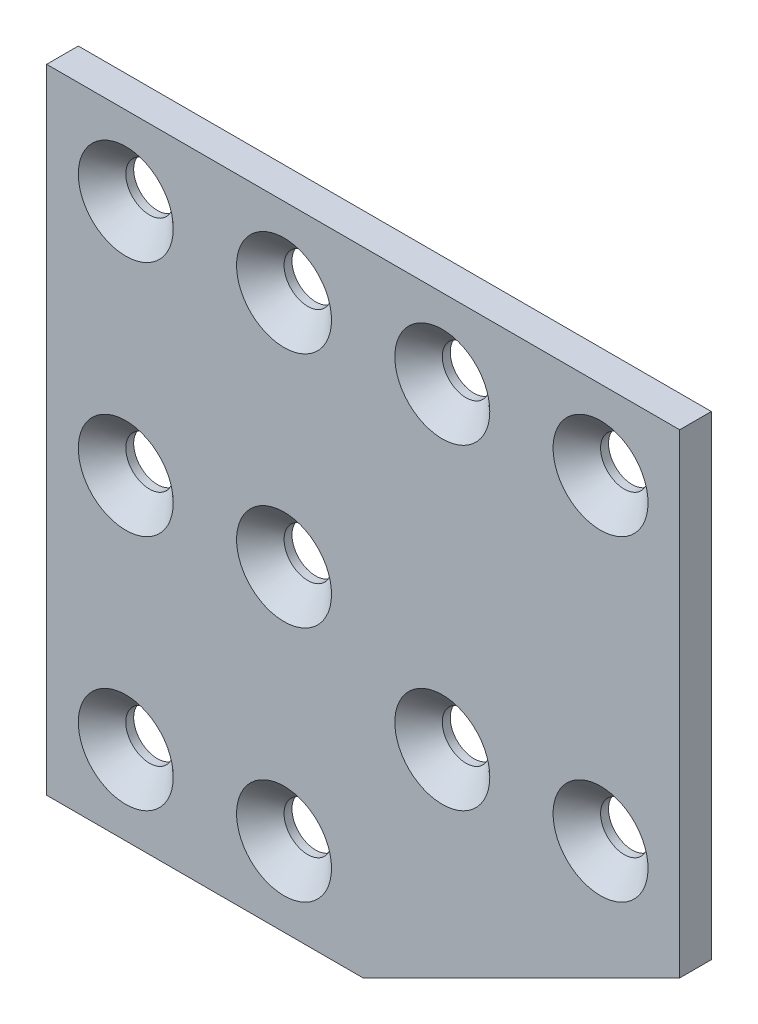
ISO-10303-21;
HEADER;
FILE_DESCRIPTION(('STEP AP214'),'2;1');
FILE_NAME('part.step','',(''),(''),'','','');
FILE_SCHEMA(('AUTOMOTIVE_DESIGN { 1 0 10303 214 1 1 1 1 }'));
ENDSEC;
DATA;
#1=APPLICATION_CONTEXT('core data for automotive mechanical design processes');
#2=APPLICATION_PROTOCOL_DEFINITION('international standard','automotive_design',2000,#1);
#3=PRODUCT_CONTEXT('',#1,'mechanical');
#4=PRODUCT('Part','Part','',(#3));
#5=PRODUCT_RELATED_PRODUCT_CATEGORY('part','',(#4));
#6=PRODUCT_DEFINITION_FORMATION('','',#4);
#7=PRODUCT_DEFINITION_CONTEXT('part definition',#1,'design');
#8=PRODUCT_DEFINITION('design','',#6,#7);
#9=PRODUCT_DEFINITION_SHAPE('','',#8);
#10=(LENGTH_UNIT() NAMED_UNIT(*) SI_UNIT(.MILLI.,.METRE.));
#11=(NAMED_UNIT(*) PLANE_ANGLE_UNIT() SI_UNIT($,.RADIAN.));
#12=(NAMED_UNIT(*) SI_UNIT($,.STERADIAN.) SOLID_ANGLE_UNIT());
#13=UNCERTAINTY_MEASURE_WITH_UNIT(LENGTH_MEASURE(1.E-05),#10,'distance_accuracy_value','');
#14=(GEOMETRIC_REPRESENTATION_CONTEXT(3) GLOBAL_UNCERTAINTY_ASSIGNED_CONTEXT((#13)) GLOBAL_UNIT_ASSIGNED_CONTEXT((#10,
#11,#12)) REPRESENTATION_CONTEXT('',''));
#15=CARTESIAN_POINT('',(0.,0.,0.));
#16=DIRECTION('',(0.,0.,1.));
#17=DIRECTION('',(1.,0.,0.));
#18=AXIS2_PLACEMENT_3D('',#15,#16,#17);
#19=CARTESIAN_POINT('',(20.,-40.,2.));
#20=DIRECTION('',(-0.447213595499958,0.894427190999916,0.));
#21=DIRECTION('',(-0.894427190999916,-0.447213595499958,0.));
#22=AXIS2_PLACEMENT_3D('',#19,#20,#21);
#23=PLANE('',#22);
#24=DIRECTION('',(0.894427190999916,0.447213595499958,0.));
#25=VECTOR('',#24,1.);
#26=CARTESIAN_POINT('',(20.,-40.,-2.));
#27=LINE('',#26,#25);
#28=CARTESIAN_POINT('',(20.,-40.,-2.));
#29=VERTEX_POINT('',#28);
#30=CARTESIAN_POINT('',(60.,-20.,-2.));
#31=VERTEX_POINT('',#30);
#32=EDGE_CURVE('E129',#29,#31,#27,.T.);
#33=ORIENTED_EDGE('',*,*,#32,.T.);
#34=DIRECTION('',(0.,0.,-1.));
#35=VECTOR('',#34,1.);
#36=CARTESIAN_POINT('',(60.,-20.,2.));
#37=LINE('',#36,#35);
#38=CARTESIAN_POINT('',(60.,-20.,2.));
#39=VERTEX_POINT('',#38);
#40=EDGE_CURVE('E151',#39,#31,#37,.T.);
#41=ORIENTED_EDGE('',*,*,#40,.F.);
#42=DIRECTION('',(0.894427190999916,0.447213595499958,0.));
#43=VECTOR('',#42,1.);
#44=CARTESIAN_POINT('',(20.,-40.,2.));
#45=LINE('',#44,#43);
#46=CARTESIAN_POINT('',(20.,-40.,2.));
#47=VERTEX_POINT('',#46);
#48=EDGE_CURVE('E94',#47,#39,#45,.T.);
#49=ORIENTED_EDGE('',*,*,#48,.F.);
#50=DIRECTION('',(0.,0.,-1.));
#51=VECTOR('',#50,1.);
#52=CARTESIAN_POINT('',(20.,-40.,2.));
#53=LINE('',#52,#51);
#54=EDGE_CURVE('E125',#47,#29,#53,.T.);
#55=ORIENTED_EDGE('',*,*,#54,.T.);
#56=EDGE_LOOP('',(#33,#41,#49,#55));
#57=FACE_BOUND('',#56,.T.);
#58=ADVANCED_FACE('F47',(#57),#23,.F.);
#59=CARTESIAN_POINT('',(60.,0.,2.));
#60=DIRECTION('',(1.,0.,0.));
#61=DIRECTION('',(0.,1.,0.));
#62=AXIS2_PLACEMENT_3D('',#59,#60,#61);
#63=PLANE('',#62);
#64=DIRECTION('',(0.,-1.,0.));
#65=VECTOR('',#64,1.);
#66=CARTESIAN_POINT('',(60.,0.,-2.));
#67=LINE('',#66,#65);
#68=CARTESIAN_POINT('',(60.,40.,-2.));
#69=VERTEX_POINT('',#68);
#70=EDGE_CURVE('E133',#69,#31,#67,.T.);
#71=ORIENTED_EDGE('',*,*,#70,.F.);
#72=DIRECTION('',(0.,0.,-1.));
#73=VECTOR('',#72,1.);
#74=CARTESIAN_POINT('',(60.,40.,2.));
#75=LINE('',#74,#73);
#76=CARTESIAN_POINT('',(60.,40.,2.));
#77=VERTEX_POINT('',#76);
#78=EDGE_CURVE('E113',#77,#69,#75,.T.);
#79=ORIENTED_EDGE('',*,*,#78,.F.);
#80=DIRECTION('',(0.,-1.,0.));
#81=VECTOR('',#80,1.);
#82=CARTESIAN_POINT('',(60.,0.,2.));
#83=LINE('',#82,#81);
#84=EDGE_CURVE('E118',#77,#39,#83,.T.);
#85=ORIENTED_EDGE('',*,*,#84,.T.);
#86=ORIENTED_EDGE('',*,*,#40,.T.);
#87=EDGE_LOOP('',(#71,#79,#85,#86));
#88=FACE_BOUND('',#87,.T.);
#89=ADVANCED_FACE('F247',(#88),#63,.T.);
#90=CARTESIAN_POINT('',(0.,40.,2.));
#91=DIRECTION('',(0.,1.,0.));
#92=DIRECTION('',(0.,0.,1.));
#93=AXIS2_PLACEMENT_3D('',#90,#91,#92);
#94=PLANE('',#93);
#95=DIRECTION('',(1.,0.,0.));
#96=VECTOR('',#95,1.);
#97=CARTESIAN_POINT('',(0.,40.,-2.));
#98=LINE('',#97,#96);
#99=CARTESIAN_POINT('',(-20.,40.,-2.));
#100=VERTEX_POINT('',#99);
#101=EDGE_CURVE('E107',#100,#69,#98,.T.);
#102=ORIENTED_EDGE('',*,*,#101,.F.);
#103=DIRECTION('',(0.,0.,-1.));
#104=VECTOR('',#103,1.);
#105=CARTESIAN_POINT('',(-20.,40.,2.));
#106=LINE('',#105,#104);
#107=CARTESIAN_POINT('',(-20.,40.,2.));
#108=VERTEX_POINT('',#107);
#109=EDGE_CURVE('E102',#108,#100,#106,.T.);
#110=ORIENTED_EDGE('',*,*,#109,.F.);
#111=DIRECTION('',(1.,0.,0.));
#112=VECTOR('',#111,1.);
#113=CARTESIAN_POINT('',(0.,40.,2.));
#114=LINE('',#113,#112);
#115=EDGE_CURVE('E105',#108,#77,#114,.T.);
#116=ORIENTED_EDGE('',*,*,#115,.T.);
#117=ORIENTED_EDGE('',*,*,#78,.T.);
#118=EDGE_LOOP('',(#102,#110,#116,#117));
#119=FACE_BOUND('',#118,.T.);
#120=ADVANCED_FACE('F104',(#119),#94,.T.);
#121=CARTESIAN_POINT('',(-20.,0.,2.));
#122=DIRECTION('',(-1.,0.,0.));
#123=DIRECTION('',(0.,0.,1.));
#124=AXIS2_PLACEMENT_3D('',#121,#122,#123);
#125=PLANE('',#124);
#126=DIRECTION('',(0.,1.,0.));
#127=VECTOR('',#126,1.);
#128=CARTESIAN_POINT('',(-20.,0.,-2.));
#129=LINE('',#128,#127);
#130=CARTESIAN_POINT('',(-20.,-40.,-2.));
#131=VERTEX_POINT('',#130);
#132=EDGE_CURVE('E140',#131,#100,#129,.T.);
#133=ORIENTED_EDGE('',*,*,#132,.F.);
#134=DIRECTION('',(0.,0.,-1.));
#135=VECTOR('',#134,1.);
#136=CARTESIAN_POINT('',(-20.,-40.,2.));
#137=LINE('',#136,#135);
#138=CARTESIAN_POINT('',(-20.,-40.,2.));
#139=VERTEX_POINT('',#138);
#140=EDGE_CURVE('E85',#139,#131,#137,.T.);
#141=ORIENTED_EDGE('',*,*,#140,.F.);
#142=DIRECTION('',(0.,1.,0.));
#143=VECTOR('',#142,1.);
#144=CARTESIAN_POINT('',(-20.,0.,2.));
#145=LINE('',#144,#143);
#146=EDGE_CURVE('E116',#139,#108,#145,.T.);
#147=ORIENTED_EDGE('',*,*,#146,.T.);
#148=ORIENTED_EDGE('',*,*,#109,.T.);
#149=EDGE_LOOP('',(#133,#141,#147,#148));
#150=FACE_BOUND('',#149,.T.);
#151=ADVANCED_FACE('F121',(#150),#125,.T.);
#152=CARTESIAN_POINT('',(0.,-40.,2.));
#153=DIRECTION('',(0.,1.,0.));
#154=DIRECTION('',(0.,0.,1.));
#155=AXIS2_PLACEMENT_3D('',#152,#153,#154);
#156=PLANE('',#155);
#157=DIRECTION('',(1.,0.,0.));
#158=VECTOR('',#157,1.);
#159=CARTESIAN_POINT('',(0.,-40.,-2.));
#160=LINE('',#159,#158);
#161=EDGE_CURVE('E88',#131,#29,#160,.T.);
#162=ORIENTED_EDGE('',*,*,#161,.T.);
#163=ORIENTED_EDGE('',*,*,#54,.F.);
#164=DIRECTION('',(1.,0.,0.));
#165=VECTOR('',#164,1.);
#166=CARTESIAN_POINT('',(0.,-40.,2.));
#167=LINE('',#166,#165);
#168=EDGE_CURVE('E66',#139,#47,#167,.T.);
#169=ORIENTED_EDGE('',*,*,#168,.F.);
#170=ORIENTED_EDGE('',*,*,#140,.T.);
#171=EDGE_LOOP('',(#162,#163,#169,#170));
#172=FACE_BOUND('',#171,.T.);
#173=ADVANCED_FACE('F340',(#172),#156,.F.);
#174=CARTESIAN_POINT('',(0.,0.,2.));
#175=DIRECTION('',(0.,0.,1.));
#176=DIRECTION('',(1.,0.,0.));
#177=AXIS2_PLACEMENT_3D('',#174,#175,#176);
#178=PLANE('',#177);
#179=CARTESIAN_POINT('',(9.99999999999999,-30.,2.));
#180=DIRECTION('',(0.,0.,1.));
#181=DIRECTION('',(1.,0.,0.));
#182=AXIS2_PLACEMENT_3D('',#179,#180,#181);
#183=CIRCLE('',#182,6.00000000000002);
#184=CARTESIAN_POINT('',(16.,-30.,2.));
#185=VERTEX_POINT('',#184);
#186=EDGE_CURVE('E194',#185,#185,#183,.F.);
#187=ORIENTED_EDGE('',*,*,#186,.T.);
#188=EDGE_LOOP('',(#187));
#189=FACE_BOUND('',#188,.T.);
#190=CARTESIAN_POINT('',(-9.99999999999999,-30.,2.));
#191=DIRECTION('',(0.,0.,1.));
#192=DIRECTION('',(1.,0.,0.));
#193=AXIS2_PLACEMENT_3D('',#190,#191,#192);
#194=CIRCLE('',#193,5.99999999999999);
#195=CARTESIAN_POINT('',(-4.,-30.,2.));
#196=VERTEX_POINT('',#195);
#197=EDGE_CURVE('E190',#196,#196,#194,.F.);
#198=ORIENTED_EDGE('',*,*,#197,.T.);
#199=EDGE_LOOP('',(#198));
#200=FACE_BOUND('',#199,.T.);
#201=CARTESIAN_POINT('',(50.,-10.,2.));
#202=DIRECTION('',(0.,0.,1.));
#203=DIRECTION('',(1.,0.,0.));
#204=AXIS2_PLACEMENT_3D('',#201,#202,#203);
#205=CIRCLE('',#204,6.00000000000002);
#206=CARTESIAN_POINT('',(56.,-10.,2.));
#207=VERTEX_POINT('',#206);
#208=EDGE_CURVE('E186',#207,#207,#205,.F.);
#209=ORIENTED_EDGE('',*,*,#208,.T.);
#210=EDGE_LOOP('',(#209));
#211=FACE_BOUND('',#210,.T.);
#212=CARTESIAN_POINT('',(30.,-10.,2.));
#213=DIRECTION('',(0.,0.,1.));
#214=DIRECTION('',(1.,0.,0.));
#215=AXIS2_PLACEMENT_3D('',#212,#213,#214);
#216=CIRCLE('',#215,5.99999999999999);
#217=CARTESIAN_POINT('',(36.,-10.,2.));
#218=VERTEX_POINT('',#217);
#219=EDGE_CURVE('E182',#218,#218,#216,.F.);
#220=ORIENTED_EDGE('',*,*,#219,.T.);
#221=EDGE_LOOP('',(#220));
#222=FACE_BOUND('',#221,.T.);
#223=CARTESIAN_POINT('',(9.99999999999999,0.,2.));
#224=DIRECTION('',(0.,0.,1.));
#225=DIRECTION('',(1.,0.,0.));
#226=AXIS2_PLACEMENT_3D('',#223,#224,#225);
#227=CIRCLE('',#226,6.00000000000002);
#228=CARTESIAN_POINT('',(16.,0.,2.));
#229=VERTEX_POINT('',#228);
#230=EDGE_CURVE('E178',#229,#229,#227,.F.);
#231=ORIENTED_EDGE('',*,*,#230,.T.);
#232=EDGE_LOOP('',(#231));
#233=FACE_BOUND('',#232,.T.);
#234=CARTESIAN_POINT('',(-9.99999999999999,0.,2.));
#235=DIRECTION('',(0.,0.,1.));
#236=DIRECTION('',(1.,0.,0.));
#237=AXIS2_PLACEMENT_3D('',#234,#235,#236);
#238=CIRCLE('',#237,6.00000000000002);
#239=CARTESIAN_POINT('',(-3.99999999999998,0.,2.));
#240=VERTEX_POINT('',#239);
#241=EDGE_CURVE('E174',#240,#240,#238,.F.);
#242=ORIENTED_EDGE('',*,*,#241,.T.);
#243=EDGE_LOOP('',(#242));
#244=FACE_BOUND('',#243,.T.);
#245=CARTESIAN_POINT('',(50.,30.,2.));
#246=DIRECTION('',(0.,0.,1.));
#247=DIRECTION('',(1.,0.,0.));
#248=AXIS2_PLACEMENT_3D('',#245,#246,#247);
#249=CIRCLE('',#248,6.00000000000002);
#250=CARTESIAN_POINT('',(56.,30.,2.));
#251=VERTEX_POINT('',#250);
#252=EDGE_CURVE('E170',#251,#251,#249,.F.);
#253=ORIENTED_EDGE('',*,*,#252,.T.);
#254=EDGE_LOOP('',(#253));
#255=FACE_BOUND('',#254,.T.);
#256=CARTESIAN_POINT('',(30.,30.,2.));
#257=DIRECTION('',(0.,0.,1.));
#258=DIRECTION('',(1.,0.,0.));
#259=AXIS2_PLACEMENT_3D('',#256,#257,#258);
#260=CIRCLE('',#259,6.00000000000002);
#261=CARTESIAN_POINT('',(36.,30.,2.));
#262=VERTEX_POINT('',#261);
#263=EDGE_CURVE('E166',#262,#262,#260,.F.);
#264=ORIENTED_EDGE('',*,*,#263,.T.);
#265=EDGE_LOOP('',(#264));
#266=FACE_BOUND('',#265,.T.);
#267=CARTESIAN_POINT('',(9.99999999999999,30.,2.));
#268=DIRECTION('',(0.,0.,1.));
#269=DIRECTION('',(1.,0.,0.));
#270=AXIS2_PLACEMENT_3D('',#267,#268,#269);
#271=CIRCLE('',#270,6.00000000000002);
#272=CARTESIAN_POINT('',(16.,30.,2.));
#273=VERTEX_POINT('',#272);
#274=EDGE_CURVE('E162',#273,#273,#271,.F.);
#275=ORIENTED_EDGE('',*,*,#274,.T.);
#276=EDGE_LOOP('',(#275));
#277=FACE_BOUND('',#276,.T.);
#278=CARTESIAN_POINT('',(-10.,30.,2.));
#279=DIRECTION('',(0.,0.,1.));
#280=DIRECTION('',(1.,0.,0.));
#281=AXIS2_PLACEMENT_3D('',#278,#279,#280);
#282=CIRCLE('',#281,6.00000000000002);
#283=CARTESIAN_POINT('',(-3.99999999999998,30.,2.));
#284=VERTEX_POINT('',#283);
#285=EDGE_CURVE('E158',#284,#284,#282,.F.);
#286=ORIENTED_EDGE('',*,*,#285,.T.);
#287=EDGE_LOOP('',(#286));
#288=FACE_BOUND('',#287,.T.);
#289=ORIENTED_EDGE('',*,*,#48,.T.);
#290=ORIENTED_EDGE('',*,*,#84,.F.);
#291=ORIENTED_EDGE('',*,*,#115,.F.);
#292=ORIENTED_EDGE('',*,*,#146,.F.);
#293=ORIENTED_EDGE('',*,*,#168,.T.);
#294=EDGE_LOOP('',(#289,#290,#291,#292,#293));
#295=FACE_BOUND('',#294,.T.);
#296=ADVANCED_FACE('F115',(#189,#200,#211,#222,#233,#244,#255,#266,#277,#288,#295),#178,.T.);
#297=CARTESIAN_POINT('',(0.,0.,-2.));
#298=DIRECTION('',(0.,0.,1.));
#299=DIRECTION('',(1.,0.,0.));
#300=AXIS2_PLACEMENT_3D('',#297,#298,#299);
#301=PLANE('',#300);
#302=CARTESIAN_POINT('',(9.99999999999999,30.,-2.));
#303=DIRECTION('',(0.,0.,1.));
#304=DIRECTION('',(1.,0.,0.));
#305=AXIS2_PLACEMENT_3D('',#302,#303,#304);
#306=CIRCLE('',#305,3.);
#307=CARTESIAN_POINT('',(13.,30.,-2.));
#308=VERTEX_POINT('',#307);
#309=EDGE_CURVE('E617',#308,#308,#306,.T.);
#310=ORIENTED_EDGE('',*,*,#309,.T.);
#311=EDGE_LOOP('',(#310));
#312=FACE_BOUND('',#311,.T.);
#313=CARTESIAN_POINT('',(-9.99999999999999,0.,-2.));
#314=DIRECTION('',(0.,0.,1.));
#315=DIRECTION('',(1.,0.,0.));
#316=AXIS2_PLACEMENT_3D('',#313,#314,#315);
#317=CIRCLE('',#316,3.);
#318=CARTESIAN_POINT('',(-6.99999999999999,0.,-2.));
#319=VERTEX_POINT('',#318);
#320=EDGE_CURVE('E614',#319,#319,#317,.T.);
#321=ORIENTED_EDGE('',*,*,#320,.T.);
#322=EDGE_LOOP('',(#321));
#323=FACE_BOUND('',#322,.T.);
#324=CARTESIAN_POINT('',(9.99999999999999,0.,-2.));
#325=DIRECTION('',(0.,0.,1.));
#326=DIRECTION('',(1.,0.,0.));
#327=AXIS2_PLACEMENT_3D('',#324,#325,#326);
#328=CIRCLE('',#327,3.);
#329=CARTESIAN_POINT('',(13.,0.,-2.));
#330=VERTEX_POINT('',#329);
#331=EDGE_CURVE('E618',#330,#330,#328,.T.);
#332=ORIENTED_EDGE('',*,*,#331,.T.);
#333=EDGE_LOOP('',(#332));
#334=FACE_BOUND('',#333,.T.);
#335=CARTESIAN_POINT('',(-9.99999999999999,-30.,-2.));
#336=DIRECTION('',(0.,0.,1.));
#337=DIRECTION('',(1.,0.,0.));
#338=AXIS2_PLACEMENT_3D('',#335,#336,#337);
#339=CIRCLE('',#338,3.);
#340=CARTESIAN_POINT('',(-6.99999999999999,-30.,-2.));
#341=VERTEX_POINT('',#340);
#342=EDGE_CURVE('E626',#341,#341,#339,.T.);
#343=ORIENTED_EDGE('',*,*,#342,.T.);
#344=EDGE_LOOP('',(#343));
#345=FACE_BOUND('',#344,.T.);
#346=CARTESIAN_POINT('',(30.,30.,-2.));
#347=DIRECTION('',(0.,0.,1.));
#348=DIRECTION('',(1.,0.,0.));
#349=AXIS2_PLACEMENT_3D('',#346,#347,#348);
#350=CIRCLE('',#349,3.);
#351=CARTESIAN_POINT('',(33.,30.,-2.));
#352=VERTEX_POINT('',#351);
#353=EDGE_CURVE('E327',#352,#352,#350,.T.);
#354=ORIENTED_EDGE('',*,*,#353,.T.);
#355=EDGE_LOOP('',(#354));
#356=FACE_BOUND('',#355,.T.);
#357=CARTESIAN_POINT('',(50.,-10.,-2.));
#358=DIRECTION('',(0.,0.,1.));
#359=DIRECTION('',(1.,0.,0.));
#360=AXIS2_PLACEMENT_3D('',#357,#358,#359);
#361=CIRCLE('',#360,3.);
#362=CARTESIAN_POINT('',(53.,-10.,-2.));
#363=VERTEX_POINT('',#362);
#364=EDGE_CURVE('E331',#363,#363,#361,.T.);
#365=ORIENTED_EDGE('',*,*,#364,.T.);
#366=EDGE_LOOP('',(#365));
#367=FACE_BOUND('',#366,.T.);
#368=CARTESIAN_POINT('',(30.,-10.,-2.));
#369=DIRECTION('',(0.,0.,1.));
#370=DIRECTION('',(1.,0.,0.));
#371=AXIS2_PLACEMENT_3D('',#368,#369,#370);
#372=CIRCLE('',#371,2.99999999999999);
#373=CARTESIAN_POINT('',(33.,-10.,-2.));
#374=VERTEX_POINT('',#373);
#375=EDGE_CURVE('E630',#374,#374,#372,.T.);
#376=ORIENTED_EDGE('',*,*,#375,.T.);
#377=EDGE_LOOP('',(#376));
#378=FACE_BOUND('',#377,.T.);
#379=CARTESIAN_POINT('',(-10.,30.,-2.));
#380=DIRECTION('',(0.,0.,1.));
#381=DIRECTION('',(1.,0.,0.));
#382=AXIS2_PLACEMENT_3D('',#379,#380,#381);
#383=CIRCLE('',#382,3.);
#384=CARTESIAN_POINT('',(-7.,30.,-2.));
#385=VERTEX_POINT('',#384);
#386=EDGE_CURVE('E623',#385,#385,#383,.T.);
#387=ORIENTED_EDGE('',*,*,#386,.T.);
#388=EDGE_LOOP('',(#387));
#389=FACE_BOUND('',#388,.T.);
#390=CARTESIAN_POINT('',(9.99999999999999,-30.,-2.));
#391=DIRECTION('',(0.,0.,1.));
#392=DIRECTION('',(1.,0.,0.));
#393=AXIS2_PLACEMENT_3D('',#390,#391,#392);
#394=CIRCLE('',#393,3.);
#395=CARTESIAN_POINT('',(13.,-30.,-2.));
#396=VERTEX_POINT('',#395);
#397=EDGE_CURVE('E642',#396,#396,#394,.T.);
#398=ORIENTED_EDGE('',*,*,#397,.T.);
#399=EDGE_LOOP('',(#398));
#400=FACE_BOUND('',#399,.T.);
#401=CARTESIAN_POINT('',(50.,30.,-2.));
#402=DIRECTION('',(0.,0.,1.));
#403=DIRECTION('',(1.,0.,0.));
#404=AXIS2_PLACEMENT_3D('',#401,#402,#403);
#405=CIRCLE('',#404,3.);
#406=CARTESIAN_POINT('',(53.,30.,-2.));
#407=VERTEX_POINT('',#406);
#408=EDGE_CURVE('E134',#407,#407,#405,.T.);
#409=ORIENTED_EDGE('',*,*,#408,.T.);
#410=EDGE_LOOP('',(#409));
#411=FACE_BOUND('',#410,.T.);
#412=ORIENTED_EDGE('',*,*,#32,.F.);
#413=ORIENTED_EDGE('',*,*,#161,.F.);
#414=ORIENTED_EDGE('',*,*,#132,.T.);
#415=ORIENTED_EDGE('',*,*,#101,.T.);
#416=ORIENTED_EDGE('',*,*,#70,.T.);
#417=EDGE_LOOP('',(#412,#413,#414,#415,#416));
#418=FACE_BOUND('',#417,.T.);
#419=ADVANCED_FACE('F321',(#312,#323,#334,#345,#356,#367,#378,#389,#400,#411,#418),#301,.F.);
#420=CARTESIAN_POINT('',(50.,30.,-2.));
#421=DIRECTION('',(0.,0.,1.));
#422=DIRECTION('',(1.,0.,0.));
#423=AXIS2_PLACEMENT_3D('',#420,#421,#422);
#424=CYLINDRICAL_SURFACE('',#423,3.);
#425=CARTESIAN_POINT('',(50.,30.,-1.));
#426=DIRECTION('',(0.,0.,1.));
#427=DIRECTION('',(1.,0.,0.));
#428=AXIS2_PLACEMENT_3D('',#425,#426,#427);
#429=CIRCLE('',#428,3.);
#430=CARTESIAN_POINT('',(53.,30.,-1.));
#431=VERTEX_POINT('',#430);
#432=EDGE_CURVE('E218',#431,#431,#429,.T.);
#433=ORIENTED_EDGE('',*,*,#432,.T.);
#434=EDGE_LOOP('',(#433));
#435=FACE_BOUND('',#434,.T.);
#436=ORIENTED_EDGE('',*,*,#408,.F.);
#437=EDGE_LOOP('',(#436));
#438=FACE_BOUND('',#437,.T.);
#439=ADVANCED_FACE('F317',(#435,#438),#424,.F.);
#440=CARTESIAN_POINT('',(9.99999999999999,-30.,-2.));
#441=DIRECTION('',(0.,0.,1.));
#442=DIRECTION('',(1.,0.,0.));
#443=AXIS2_PLACEMENT_3D('',#440,#441,#442);
#444=CYLINDRICAL_SURFACE('',#443,3.);
#445=CARTESIAN_POINT('',(9.99999999999999,-30.,-1.));
#446=DIRECTION('',(0.,0.,1.));
#447=DIRECTION('',(1.,0.,0.));
#448=AXIS2_PLACEMENT_3D('',#445,#446,#447);
#449=CIRCLE('',#448,3.);
#450=CARTESIAN_POINT('',(13.,-30.,-1.));
#451=VERTEX_POINT('',#450);
#452=EDGE_CURVE('E154',#451,#451,#449,.T.);
#453=ORIENTED_EDGE('',*,*,#452,.T.);
#454=EDGE_LOOP('',(#453));
#455=FACE_BOUND('',#454,.T.);
#456=ORIENTED_EDGE('',*,*,#397,.F.);
#457=EDGE_LOOP('',(#456));
#458=FACE_BOUND('',#457,.T.);
#459=ADVANCED_FACE('F320',(#455,#458),#444,.F.);
#460=CARTESIAN_POINT('',(-10.,30.,-2.));
#461=DIRECTION('',(0.,0.,1.));
#462=DIRECTION('',(1.,0.,0.));
#463=AXIS2_PLACEMENT_3D('',#460,#461,#462);
#464=CYLINDRICAL_SURFACE('',#463,3.);
#465=CARTESIAN_POINT('',(-10.,30.,-1.));
#466=DIRECTION('',(0.,0.,1.));
#467=DIRECTION('',(1.,0.,0.));
#468=AXIS2_PLACEMENT_3D('',#465,#466,#467);
#469=CIRCLE('',#468,3.);
#470=CARTESIAN_POINT('',(-7.,30.,-1.));
#471=VERTEX_POINT('',#470);
#472=EDGE_CURVE('E11',#471,#471,#469,.T.);
#473=ORIENTED_EDGE('',*,*,#472,.T.);
#474=EDGE_LOOP('',(#473));
#475=FACE_BOUND('',#474,.T.);
#476=ORIENTED_EDGE('',*,*,#386,.F.);
#477=EDGE_LOOP('',(#476));
#478=FACE_BOUND('',#477,.T.);
#479=ADVANCED_FACE('F400',(#475,#478),#464,.F.);
#480=CARTESIAN_POINT('',(30.,-10.,-2.));
#481=DIRECTION('',(0.,0.,1.));
#482=DIRECTION('',(1.,0.,0.));
#483=AXIS2_PLACEMENT_3D('',#480,#481,#482);
#484=CYLINDRICAL_SURFACE('',#483,2.99999999999999);
#485=CARTESIAN_POINT('',(30.,-10.,-0.999999999999994));
#486=DIRECTION('',(0.,0.,1.));
#487=DIRECTION('',(1.,0.,0.));
#488=AXIS2_PLACEMENT_3D('',#485,#486,#487);
#489=CIRCLE('',#488,2.99999999999999);
#490=CARTESIAN_POINT('',(33.,-10.,-0.999999999999994));
#491=VERTEX_POINT('',#490);
#492=EDGE_CURVE('E206',#491,#491,#489,.T.);
#493=ORIENTED_EDGE('',*,*,#492,.T.);
#494=EDGE_LOOP('',(#493));
#495=FACE_BOUND('',#494,.T.);
#496=ORIENTED_EDGE('',*,*,#375,.F.);
#497=EDGE_LOOP('',(#496));
#498=FACE_BOUND('',#497,.T.);
#499=ADVANCED_FACE('F411',(#495,#498),#484,.F.);
#500=CARTESIAN_POINT('',(50.,-10.,-2.));
#501=DIRECTION('',(0.,0.,1.));
#502=DIRECTION('',(1.,0.,0.));
#503=AXIS2_PLACEMENT_3D('',#500,#501,#502);
#504=CYLINDRICAL_SURFACE('',#503,3.);
#505=CARTESIAN_POINT('',(50.,-10.,-1.));
#506=DIRECTION('',(0.,0.,1.));
#507=DIRECTION('',(1.,0.,0.));
#508=AXIS2_PLACEMENT_3D('',#505,#506,#507);
#509=CIRCLE('',#508,3.);
#510=CARTESIAN_POINT('',(53.,-10.,-1.));
#511=VERTEX_POINT('',#510);
#512=EDGE_CURVE('E202',#511,#511,#509,.T.);
#513=ORIENTED_EDGE('',*,*,#512,.T.);
#514=EDGE_LOOP('',(#513));
#515=FACE_BOUND('',#514,.T.);
#516=ORIENTED_EDGE('',*,*,#364,.F.);
#517=EDGE_LOOP('',(#516));
#518=FACE_BOUND('',#517,.T.);
#519=ADVANCED_FACE('F422',(#515,#518),#504,.F.);
#520=CARTESIAN_POINT('',(30.,30.,-2.));
#521=DIRECTION('',(0.,0.,1.));
#522=DIRECTION('',(1.,0.,0.));
#523=AXIS2_PLACEMENT_3D('',#520,#521,#522);
#524=CYLINDRICAL_SURFACE('',#523,3.);
#525=CARTESIAN_POINT('',(30.,30.,-1.));
#526=DIRECTION('',(0.,0.,1.));
#527=DIRECTION('',(1.,0.,0.));
#528=AXIS2_PLACEMENT_3D('',#525,#526,#527);
#529=CIRCLE('',#528,3.);
#530=CARTESIAN_POINT('',(33.,30.,-1.));
#531=VERTEX_POINT('',#530);
#532=EDGE_CURVE('E222',#531,#531,#529,.T.);
#533=ORIENTED_EDGE('',*,*,#532,.T.);
#534=EDGE_LOOP('',(#533));
#535=FACE_BOUND('',#534,.T.);
#536=ORIENTED_EDGE('',*,*,#353,.F.);
#537=EDGE_LOOP('',(#536));
#538=FACE_BOUND('',#537,.T.);
#539=ADVANCED_FACE('F433',(#535,#538),#524,.F.);
#540=CARTESIAN_POINT('',(-9.99999999999999,-30.,-2.));
#541=DIRECTION('',(0.,0.,1.));
#542=DIRECTION('',(1.,0.,0.));
#543=AXIS2_PLACEMENT_3D('',#540,#541,#542);
#544=CYLINDRICAL_SURFACE('',#543,3.);
#545=CARTESIAN_POINT('',(-9.99999999999999,-30.,-0.999999999999987));
#546=DIRECTION('',(0.,0.,1.));
#547=DIRECTION('',(1.,0.,0.));
#548=AXIS2_PLACEMENT_3D('',#545,#546,#547);
#549=CIRCLE('',#548,3.);
#550=CARTESIAN_POINT('',(-6.99999999999999,-30.,-0.999999999999987));
#551=VERTEX_POINT('',#550);
#552=EDGE_CURVE('E198',#551,#551,#549,.T.);
#553=ORIENTED_EDGE('',*,*,#552,.T.);
#554=EDGE_LOOP('',(#553));
#555=FACE_BOUND('',#554,.T.);
#556=ORIENTED_EDGE('',*,*,#342,.F.);
#557=EDGE_LOOP('',(#556));
#558=FACE_BOUND('',#557,.T.);
#559=ADVANCED_FACE('F444',(#555,#558),#544,.F.);
#560=CARTESIAN_POINT('',(9.99999999999999,0.,-2.));
#561=DIRECTION('',(0.,0.,1.));
#562=DIRECTION('',(1.,0.,0.));
#563=AXIS2_PLACEMENT_3D('',#560,#561,#562);
#564=CYLINDRICAL_SURFACE('',#563,3.);
#565=CARTESIAN_POINT('',(9.99999999999999,0.,-1.));
#566=DIRECTION('',(0.,0.,1.));
#567=DIRECTION('',(1.,0.,0.));
#568=AXIS2_PLACEMENT_3D('',#565,#566,#567);
#569=CIRCLE('',#568,3.);
#570=CARTESIAN_POINT('',(13.,0.,-1.));
#571=VERTEX_POINT('',#570);
#572=EDGE_CURVE('E210',#571,#571,#569,.T.);
#573=ORIENTED_EDGE('',*,*,#572,.T.);
#574=EDGE_LOOP('',(#573));
#575=FACE_BOUND('',#574,.T.);
#576=ORIENTED_EDGE('',*,*,#331,.F.);
#577=EDGE_LOOP('',(#576));
#578=FACE_BOUND('',#577,.T.);
#579=ADVANCED_FACE('F455',(#575,#578),#564,.F.);
#580=CARTESIAN_POINT('',(-9.99999999999999,0.,-2.));
#581=DIRECTION('',(0.,0.,1.));
#582=DIRECTION('',(1.,0.,0.));
#583=AXIS2_PLACEMENT_3D('',#580,#581,#582);
#584=CYLINDRICAL_SURFACE('',#583,3.);
#585=CARTESIAN_POINT('',(-9.99999999999999,0.,-1.));
#586=DIRECTION('',(0.,0.,1.));
#587=DIRECTION('',(1.,0.,0.));
#588=AXIS2_PLACEMENT_3D('',#585,#586,#587);
#589=CIRCLE('',#588,3.);
#590=CARTESIAN_POINT('',(-6.99999999999999,0.,-1.));
#591=VERTEX_POINT('',#590);
#592=EDGE_CURVE('E214',#591,#591,#589,.T.);
#593=ORIENTED_EDGE('',*,*,#592,.T.);
#594=EDGE_LOOP('',(#593));
#595=FACE_BOUND('',#594,.T.);
#596=ORIENTED_EDGE('',*,*,#320,.F.);
#597=EDGE_LOOP('',(#596));
#598=FACE_BOUND('',#597,.T.);
#599=ADVANCED_FACE('F466',(#595,#598),#584,.F.);
#600=CARTESIAN_POINT('',(9.99999999999999,30.,-2.));
#601=DIRECTION('',(0.,0.,1.));
#602=DIRECTION('',(1.,0.,0.));
#603=AXIS2_PLACEMENT_3D('',#600,#601,#602);
#604=CYLINDRICAL_SURFACE('',#603,3.);
#605=CARTESIAN_POINT('',(9.99999999999999,30.,-1.));
#606=DIRECTION('',(0.,0.,1.));
#607=DIRECTION('',(1.,0.,0.));
#608=AXIS2_PLACEMENT_3D('',#605,#606,#607);
#609=CIRCLE('',#608,3.);
#610=CARTESIAN_POINT('',(13.,30.,-1.));
#611=VERTEX_POINT('',#610);
#612=EDGE_CURVE('E58',#611,#611,#609,.T.);
#613=ORIENTED_EDGE('',*,*,#612,.T.);
#614=EDGE_LOOP('',(#613));
#615=FACE_BOUND('',#614,.T.);
#616=ORIENTED_EDGE('',*,*,#309,.F.);
#617=EDGE_LOOP('',(#616));
#618=FACE_BOUND('',#617,.T.);
#619=ADVANCED_FACE('F229',(#615,#618),#604,.F.);
#620=CARTESIAN_POINT('',(9.99999999999999,-30.,-1.));
#621=DIRECTION('',(0.,0.,1.));
#622=DIRECTION('',(1.,0.,0.));
#623=AXIS2_PLACEMENT_3D('',#620,#621,#622);
#624=CONICAL_SURFACE('',#623,3.,0.785398163397451);
#625=ORIENTED_EDGE('',*,*,#186,.F.);
#626=EDGE_LOOP('',(#625));
#627=FACE_BOUND('',#626,.T.);
#628=ORIENTED_EDGE('',*,*,#452,.F.);
#629=EDGE_LOOP('',(#628));
#630=FACE_BOUND('',#629,.T.);
#631=ADVANCED_FACE('F258',(#627,#630),#624,.F.);
#632=CARTESIAN_POINT('',(-9.99999999999999,-30.,-0.999999999999987));
#633=DIRECTION('',(0.,0.,1.));
#634=DIRECTION('',(1.,0.,0.));
#635=AXIS2_PLACEMENT_3D('',#632,#633,#634);
#636=CONICAL_SURFACE('',#635,3.,0.785398163397449);
#637=ORIENTED_EDGE('',*,*,#197,.F.);
#638=EDGE_LOOP('',(#637));
#639=FACE_BOUND('',#638,.T.);
#640=ORIENTED_EDGE('',*,*,#552,.F.);
#641=EDGE_LOOP('',(#640));
#642=FACE_BOUND('',#641,.T.);
#643=ADVANCED_FACE('F264',(#639,#642),#636,.F.);
#644=CARTESIAN_POINT('',(50.,-10.,-1.));
#645=DIRECTION('',(0.,0.,1.));
#646=DIRECTION('',(1.,0.,0.));
#647=AXIS2_PLACEMENT_3D('',#644,#645,#646);
#648=CONICAL_SURFACE('',#647,3.,0.785398163397451);
#649=ORIENTED_EDGE('',*,*,#208,.F.);
#650=EDGE_LOOP('',(#649));
#651=FACE_BOUND('',#650,.T.);
#652=ORIENTED_EDGE('',*,*,#512,.F.);
#653=EDGE_LOOP('',(#652));
#654=FACE_BOUND('',#653,.T.);
#655=ADVANCED_FACE('F271',(#651,#654),#648,.F.);
#656=CARTESIAN_POINT('',(30.,-10.,-0.999999999999994));
#657=DIRECTION('',(0.,0.,1.));
#658=DIRECTION('',(1.,0.,0.));
#659=AXIS2_PLACEMENT_3D('',#656,#657,#658);
#660=CONICAL_SURFACE('',#659,2.99999999999999,0.785398163397449);
#661=ORIENTED_EDGE('',*,*,#219,.F.);
#662=EDGE_LOOP('',(#661));
#663=FACE_BOUND('',#662,.T.);
#664=ORIENTED_EDGE('',*,*,#492,.F.);
#665=EDGE_LOOP('',(#664));
#666=FACE_BOUND('',#665,.T.);
#667=ADVANCED_FACE('F278',(#663,#666),#660,.F.);
#668=CARTESIAN_POINT('',(9.99999999999999,0.,-1.));
#669=DIRECTION('',(0.,0.,1.));
#670=DIRECTION('',(1.,0.,0.));
#671=AXIS2_PLACEMENT_3D('',#668,#669,#670);
#672=CONICAL_SURFACE('',#671,3.,0.785398163397451);
#673=ORIENTED_EDGE('',*,*,#230,.F.);
#674=EDGE_LOOP('',(#673));
#675=FACE_BOUND('',#674,.T.);
#676=ORIENTED_EDGE('',*,*,#572,.F.);
#677=EDGE_LOOP('',(#676));
#678=FACE_BOUND('',#677,.T.);
#679=ADVANCED_FACE('F285',(#675,#678),#672,.F.);
#680=CARTESIAN_POINT('',(-9.99999999999999,0.,-1.));
#681=DIRECTION('',(0.,0.,1.));
#682=DIRECTION('',(1.,0.,0.));
#683=AXIS2_PLACEMENT_3D('',#680,#681,#682);
#684=CONICAL_SURFACE('',#683,3.,0.785398163397451);
#685=ORIENTED_EDGE('',*,*,#241,.F.);
#686=EDGE_LOOP('',(#685));
#687=FACE_BOUND('',#686,.T.);
#688=ORIENTED_EDGE('',*,*,#592,.F.);
#689=EDGE_LOOP('',(#688));
#690=FACE_BOUND('',#689,.T.);
#691=ADVANCED_FACE('F292',(#687,#690),#684,.F.);
#692=CARTESIAN_POINT('',(50.,30.,-1.));
#693=DIRECTION('',(0.,0.,1.));
#694=DIRECTION('',(1.,0.,0.));
#695=AXIS2_PLACEMENT_3D('',#692,#693,#694);
#696=CONICAL_SURFACE('',#695,3.,0.785398163397451);
#697=ORIENTED_EDGE('',*,*,#252,.F.);
#698=EDGE_LOOP('',(#697));
#699=FACE_BOUND('',#698,.T.);
#700=ORIENTED_EDGE('',*,*,#432,.F.);
#701=EDGE_LOOP('',(#700));
#702=FACE_BOUND('',#701,.T.);
#703=ADVANCED_FACE('F241',(#699,#702),#696,.F.);
#704=CARTESIAN_POINT('',(30.,30.,-1.));
#705=DIRECTION('',(0.,0.,1.));
#706=DIRECTION('',(1.,0.,0.));
#707=AXIS2_PLACEMENT_3D('',#704,#705,#706);
#708=CONICAL_SURFACE('',#707,3.,0.785398163397452);
#709=ORIENTED_EDGE('',*,*,#263,.F.);
#710=EDGE_LOOP('',(#709));
#711=FACE_BOUND('',#710,.T.);
#712=ORIENTED_EDGE('',*,*,#532,.F.);
#713=EDGE_LOOP('',(#712));
#714=FACE_BOUND('',#713,.T.);
#715=ADVANCED_FACE('F234',(#711,#714),#708,.F.);
#716=CARTESIAN_POINT('',(9.99999999999999,30.,-1.));
#717=DIRECTION('',(0.,0.,1.));
#718=DIRECTION('',(1.,0.,0.));
#719=AXIS2_PLACEMENT_3D('',#716,#717,#718);
#720=CONICAL_SURFACE('',#719,3.,0.785398163397451);
#721=ORIENTED_EDGE('',*,*,#274,.F.);
#722=EDGE_LOOP('',(#721));
#723=FACE_BOUND('',#722,.T.);
#724=ORIENTED_EDGE('',*,*,#612,.F.);
#725=EDGE_LOOP('',(#724));
#726=FACE_BOUND('',#725,.T.);
#727=ADVANCED_FACE('F232',(#723,#726),#720,.F.);
#728=CARTESIAN_POINT('',(-10.,30.,-1.));
#729=DIRECTION('',(0.,0.,1.));
#730=DIRECTION('',(1.,0.,0.));
#731=AXIS2_PLACEMENT_3D('',#728,#729,#730);
#732=CONICAL_SURFACE('',#731,3.,0.785398163397451);
#733=ORIENTED_EDGE('',*,*,#285,.F.);
#734=EDGE_LOOP('',(#733));
#735=FACE_BOUND('',#734,.T.);
#736=ORIENTED_EDGE('',*,*,#472,.F.);
#737=EDGE_LOOP('',(#736));
#738=FACE_BOUND('',#737,.T.);
#739=ADVANCED_FACE('F50',(#735,#738),#732,.F.);
#740=CLOSED_SHELL('',(#58,#89,#120,#151,#173,#296,#419,#439,#459,#479,#499,#519,#539,#559,#579,
#599,#619,#631,#643,#655,#667,#679,#691,#703,#715,#727,#739));
#741=MANIFOLD_SOLID_BREP('B2',#740);
#742=ADVANCED_BREP_SHAPE_REPRESENTATION('',(#18,#741),#14);
#743=SHAPE_DEFINITION_REPRESENTATION(#9,#742);
ENDSEC;
END-ISO-10303-21;
